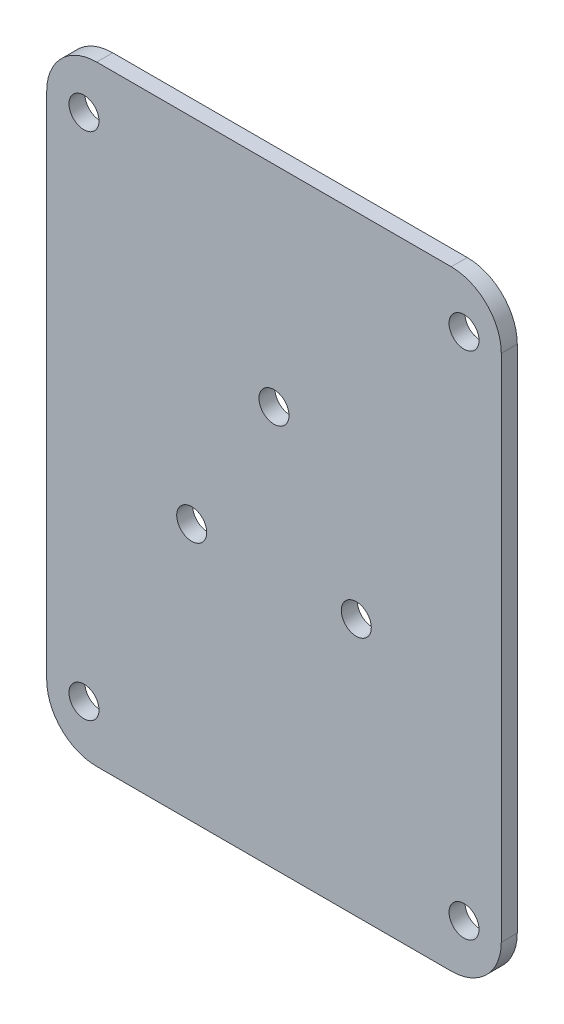
ISO-10303-21;
HEADER;
FILE_DESCRIPTION(('STEP AP214'),'2;1');
FILE_NAME('part.step','',(''),(''),'','','');
FILE_SCHEMA(('AUTOMOTIVE_DESIGN { 1 0 10303 214 1 1 1 1 }'));
ENDSEC;
DATA;
#1=APPLICATION_CONTEXT('core data for automotive mechanical design processes');
#2=APPLICATION_PROTOCOL_DEFINITION('international standard','automotive_design',2000,#1);
#3=PRODUCT_CONTEXT('',#1,'mechanical');
#4=PRODUCT('Part','Part','',(#3));
#5=PRODUCT_RELATED_PRODUCT_CATEGORY('part','',(#4));
#6=PRODUCT_DEFINITION_FORMATION('','',#4);
#7=PRODUCT_DEFINITION_CONTEXT('part definition',#1,'design');
#8=PRODUCT_DEFINITION('design','',#6,#7);
#9=PRODUCT_DEFINITION_SHAPE('','',#8);
#10=(LENGTH_UNIT() NAMED_UNIT(*) SI_UNIT(.MILLI.,.METRE.));
#11=(NAMED_UNIT(*) PLANE_ANGLE_UNIT() SI_UNIT($,.RADIAN.));
#12=(NAMED_UNIT(*) SI_UNIT($,.STERADIAN.) SOLID_ANGLE_UNIT());
#13=UNCERTAINTY_MEASURE_WITH_UNIT(LENGTH_MEASURE(1.E-05),#10,'distance_accuracy_value','');
#14=(GEOMETRIC_REPRESENTATION_CONTEXT(3) GLOBAL_UNCERTAINTY_ASSIGNED_CONTEXT((#13)) GLOBAL_UNIT_ASSIGNED_CONTEXT((#10,
#11,#12)) REPRESENTATION_CONTEXT('',''));
#15=CARTESIAN_POINT('',(0.,0.,0.));
#16=DIRECTION('',(0.,0.,1.));
#17=DIRECTION('',(1.,0.,0.));
#18=AXIS2_PLACEMENT_3D('',#15,#16,#17);
#19=CARTESIAN_POINT('',(0.,0.,1.6));
#20=DIRECTION('',(0.,0.,1.));
#21=DIRECTION('',(1.,0.,0.));
#22=AXIS2_PLACEMENT_3D('',#19,#20,#21);
#23=PLANE('',#22);
#24=CARTESIAN_POINT('',(8.22724133595215,-4.75000000000004,1.6));
#25=DIRECTION('',(0.,0.,1.));
#26=DIRECTION('',(1.,0.,0.));
#27=AXIS2_PLACEMENT_3D('',#24,#25,#26);
#28=CIRCLE('',#27,1.5);
#29=CARTESIAN_POINT('',(9.72724133595215,-4.75000000000004,1.6));
#30=VERTEX_POINT('',#29);
#31=EDGE_CURVE('E210',#30,#30,#28,.T.);
#32=ORIENTED_EDGE('',*,*,#31,.F.);
#33=EDGE_LOOP('',(#32));
#34=FACE_BOUND('',#33,.T.);
#35=CARTESIAN_POINT('',(19.,25.5,1.6));
#36=DIRECTION('',(0.,0.,1.));
#37=DIRECTION('',(1.,0.,0.));
#38=AXIS2_PLACEMENT_3D('',#35,#36,#37);
#39=CIRCLE('',#38,1.5);
#40=CARTESIAN_POINT('',(20.5,25.5,1.6));
#41=VERTEX_POINT('',#40);
#42=EDGE_CURVE('E198',#41,#41,#39,.T.);
#43=ORIENTED_EDGE('',*,*,#42,.F.);
#44=EDGE_LOOP('',(#43));
#45=FACE_BOUND('',#44,.T.);
#46=CARTESIAN_POINT('',(-19.,-25.5,1.6));
#47=DIRECTION('',(0.,0.,1.));
#48=DIRECTION('',(1.,0.,0.));
#49=AXIS2_PLACEMENT_3D('',#46,#47,#48);
#50=CIRCLE('',#49,1.5);
#51=CARTESIAN_POINT('',(-17.5,-25.5,1.6));
#52=VERTEX_POINT('',#51);
#53=EDGE_CURVE('E187',#52,#52,#50,.T.);
#54=ORIENTED_EDGE('',*,*,#53,.F.);
#55=EDGE_LOOP('',(#54));
#56=FACE_BOUND('',#55,.T.);
#57=DIRECTION('',(-1.,0.,0.));
#58=VECTOR('',#57,1.);
#59=CARTESIAN_POINT('',(-22.7254901960784,30.5,1.6));
#60=LINE('',#59,#58);
#61=CARTESIAN_POINT('',(17.7254901960784,30.5,1.6));
#62=VERTEX_POINT('',#61);
#63=CARTESIAN_POINT('',(-17.7254901960784,30.5,1.6));
#64=VERTEX_POINT('',#63);
#65=EDGE_CURVE('E173',#62,#64,#60,.T.);
#66=ORIENTED_EDGE('',*,*,#65,.T.);
#67=CARTESIAN_POINT('',(-17.7254901960784,25.5,1.6));
#68=DIRECTION('',(0.,0.,1.));
#69=DIRECTION('',(1.,0.,0.));
#70=AXIS2_PLACEMENT_3D('',#67,#68,#69);
#71=CIRCLE('',#70,5.);
#72=CARTESIAN_POINT('',(-22.7254901960784,25.5,1.6));
#73=VERTEX_POINT('',#72);
#74=EDGE_CURVE('E151',#64,#73,#71,.T.);
#75=ORIENTED_EDGE('',*,*,#74,.T.);
#76=DIRECTION('',(0.,-1.,0.));
#77=VECTOR('',#76,1.);
#78=CARTESIAN_POINT('',(-22.7254901960784,30.5,1.6));
#79=LINE('',#78,#77);
#80=CARTESIAN_POINT('',(-22.7254901960784,-25.5,1.6));
#81=VERTEX_POINT('',#80);
#82=EDGE_CURVE('E121',#73,#81,#79,.T.);
#83=ORIENTED_EDGE('',*,*,#82,.T.);
#84=CARTESIAN_POINT('',(-17.7254901960784,-25.5,1.6));
#85=DIRECTION('',(0.,0.,1.));
#86=DIRECTION('',(1.,0.,0.));
#87=AXIS2_PLACEMENT_3D('',#84,#85,#86);
#88=CIRCLE('',#87,5.);
#89=CARTESIAN_POINT('',(-17.7254901960784,-30.5,1.6));
#90=VERTEX_POINT('',#89);
#91=EDGE_CURVE('E57',#81,#90,#88,.T.);
#92=ORIENTED_EDGE('',*,*,#91,.T.);
#93=DIRECTION('',(1.,0.,0.));
#94=VECTOR('',#93,1.);
#95=CARTESIAN_POINT('',(-22.7254901960784,-30.5,1.6));
#96=LINE('',#95,#94);
#97=CARTESIAN_POINT('',(17.7254901960784,-30.5,1.6));
#98=VERTEX_POINT('',#97);
#99=EDGE_CURVE('E137',#90,#98,#96,.T.);
#100=ORIENTED_EDGE('',*,*,#99,.T.);
#101=CARTESIAN_POINT('',(17.7254901960784,-25.5,1.6));
#102=DIRECTION('',(0.,0.,1.));
#103=DIRECTION('',(1.,0.,0.));
#104=AXIS2_PLACEMENT_3D('',#101,#102,#103);
#105=CIRCLE('',#104,5.);
#106=CARTESIAN_POINT('',(22.7254901960784,-25.5,1.6));
#107=VERTEX_POINT('',#106);
#108=EDGE_CURVE('E147',#98,#107,#105,.T.);
#109=ORIENTED_EDGE('',*,*,#108,.T.);
#110=DIRECTION('',(0.,1.,0.));
#111=VECTOR('',#110,1.);
#112=CARTESIAN_POINT('',(22.7254901960784,30.5,1.6));
#113=LINE('',#112,#111);
#114=CARTESIAN_POINT('',(22.7254901960784,25.5,1.6));
#115=VERTEX_POINT('',#114);
#116=EDGE_CURVE('E131',#107,#115,#113,.T.);
#117=ORIENTED_EDGE('',*,*,#116,.T.);
#118=CARTESIAN_POINT('',(17.7254901960784,25.5,1.6));
#119=DIRECTION('',(0.,0.,1.));
#120=DIRECTION('',(1.,0.,0.));
#121=AXIS2_PLACEMENT_3D('',#118,#119,#120);
#122=CIRCLE('',#121,5.);
#123=EDGE_CURVE('E149',#115,#62,#122,.T.);
#124=ORIENTED_EDGE('',*,*,#123,.T.);
#125=EDGE_LOOP('',(#66,#75,#83,#92,#100,#109,#117,#124));
#126=FACE_BOUND('',#125,.T.);
#127=CARTESIAN_POINT('',(19.,-25.5,1.6));
#128=DIRECTION('',(0.,0.,1.));
#129=DIRECTION('',(1.,0.,0.));
#130=AXIS2_PLACEMENT_3D('',#127,#128,#129);
#131=CIRCLE('',#130,1.5);
#132=CARTESIAN_POINT('',(20.5,-25.5,1.6));
#133=VERTEX_POINT('',#132);
#134=EDGE_CURVE('E182',#133,#133,#131,.T.);
#135=ORIENTED_EDGE('',*,*,#134,.F.);
#136=EDGE_LOOP('',(#135));
#137=FACE_BOUND('',#136,.T.);
#138=CARTESIAN_POINT('',(-19.,25.5,1.6));
#139=DIRECTION('',(0.,0.,1.));
#140=DIRECTION('',(1.,0.,0.));
#141=AXIS2_PLACEMENT_3D('',#138,#139,#140);
#142=CIRCLE('',#141,1.5);
#143=CARTESIAN_POINT('',(-17.5,25.5,1.6));
#144=VERTEX_POINT('',#143);
#145=EDGE_CURVE('E192',#144,#144,#142,.T.);
#146=ORIENTED_EDGE('',*,*,#145,.F.);
#147=EDGE_LOOP('',(#146));
#148=FACE_BOUND('',#147,.T.);
#149=CARTESIAN_POINT('',(-8.22724133595214,-4.75000000000004,1.6));
#150=DIRECTION('',(0.,0.,1.));
#151=DIRECTION('',(1.,0.,0.));
#152=AXIS2_PLACEMENT_3D('',#149,#150,#151);
#153=CIRCLE('',#152,1.50000000000001);
#154=CARTESIAN_POINT('',(-6.72724133595214,-4.75000000000004,1.6));
#155=VERTEX_POINT('',#154);
#156=EDGE_CURVE('E204',#155,#155,#153,.T.);
#157=ORIENTED_EDGE('',*,*,#156,.F.);
#158=EDGE_LOOP('',(#157));
#159=FACE_BOUND('',#158,.T.);
#160=CARTESIAN_POINT('',(0.,9.5,1.6));
#161=DIRECTION('',(0.,0.,1.));
#162=DIRECTION('',(1.,0.,0.));
#163=AXIS2_PLACEMENT_3D('',#160,#161,#162);
#164=CIRCLE('',#163,1.5);
#165=CARTESIAN_POINT('',(1.50000000000001,9.5,1.6));
#166=VERTEX_POINT('',#165);
#167=EDGE_CURVE('E216',#166,#166,#164,.T.);
#168=ORIENTED_EDGE('',*,*,#167,.F.);
#169=EDGE_LOOP('',(#168));
#170=FACE_BOUND('',#169,.T.);
#171=ADVANCED_FACE('F37',(#34,#45,#56,#126,#137,#148,#159,#170),#23,.T.);
#172=CARTESIAN_POINT('',(0.,0.,0.));
#173=DIRECTION('',(0.,0.,1.));
#174=DIRECTION('',(1.,0.,0.));
#175=AXIS2_PLACEMENT_3D('',#172,#173,#174);
#176=PLANE('',#175);
#177=CARTESIAN_POINT('',(8.22724133595215,-4.75000000000004,0.));
#178=DIRECTION('',(0.,0.,1.));
#179=DIRECTION('',(1.,0.,0.));
#180=AXIS2_PLACEMENT_3D('',#177,#178,#179);
#181=CIRCLE('',#180,1.5);
#182=CARTESIAN_POINT('',(9.72724133595215,-4.75000000000004,0.));
#183=VERTEX_POINT('',#182);
#184=EDGE_CURVE('E213',#183,#183,#181,.T.);
#185=ORIENTED_EDGE('',*,*,#184,.T.);
#186=EDGE_LOOP('',(#185));
#187=FACE_BOUND('',#186,.T.);
#188=CARTESIAN_POINT('',(19.,25.5,0.));
#189=DIRECTION('',(0.,0.,1.));
#190=DIRECTION('',(1.,0.,0.));
#191=AXIS2_PLACEMENT_3D('',#188,#189,#190);
#192=CIRCLE('',#191,1.5);
#193=CARTESIAN_POINT('',(20.5,25.5,0.));
#194=VERTEX_POINT('',#193);
#195=EDGE_CURVE('E201',#194,#194,#192,.T.);
#196=ORIENTED_EDGE('',*,*,#195,.T.);
#197=EDGE_LOOP('',(#196));
#198=FACE_BOUND('',#197,.T.);
#199=CARTESIAN_POINT('',(-19.,-25.5,0.));
#200=DIRECTION('',(0.,0.,1.));
#201=DIRECTION('',(1.,0.,0.));
#202=AXIS2_PLACEMENT_3D('',#199,#200,#201);
#203=CIRCLE('',#202,1.5);
#204=CARTESIAN_POINT('',(-17.5,-25.5,0.));
#205=VERTEX_POINT('',#204);
#206=EDGE_CURVE('E189',#205,#205,#203,.T.);
#207=ORIENTED_EDGE('',*,*,#206,.T.);
#208=EDGE_LOOP('',(#207));
#209=FACE_BOUND('',#208,.T.);
#210=DIRECTION('',(0.,-1.,0.));
#211=VECTOR('',#210,1.);
#212=CARTESIAN_POINT('',(-22.7254901960784,30.5,0.));
#213=LINE('',#212,#211);
#214=CARTESIAN_POINT('',(-22.7254901960784,25.5,0.));
#215=VERTEX_POINT('',#214);
#216=CARTESIAN_POINT('',(-22.7254901960784,-25.5,0.));
#217=VERTEX_POINT('',#216);
#218=EDGE_CURVE('E119',#215,#217,#213,.T.);
#219=ORIENTED_EDGE('',*,*,#218,.F.);
#220=CARTESIAN_POINT('',(-17.7254901960784,25.5,0.));
#221=DIRECTION('',(0.,0.,1.));
#222=DIRECTION('',(1.,0.,0.));
#223=AXIS2_PLACEMENT_3D('',#220,#221,#222);
#224=CIRCLE('',#223,5.);
#225=CARTESIAN_POINT('',(-17.7254901960784,30.5,0.));
#226=VERTEX_POINT('',#225);
#227=EDGE_CURVE('E102',#215,#226,#224,.F.);
#228=ORIENTED_EDGE('',*,*,#227,.T.);
#229=DIRECTION('',(-1.,0.,0.));
#230=VECTOR('',#229,1.);
#231=CARTESIAN_POINT('',(-22.7254901960784,30.5,0.));
#232=LINE('',#231,#230);
#233=CARTESIAN_POINT('',(17.7254901960784,30.5,0.));
#234=VERTEX_POINT('',#233);
#235=EDGE_CURVE('E129',#234,#226,#232,.T.);
#236=ORIENTED_EDGE('',*,*,#235,.F.);
#237=CARTESIAN_POINT('',(17.7254901960784,25.5,0.));
#238=DIRECTION('',(0.,0.,1.));
#239=DIRECTION('',(1.,0.,0.));
#240=AXIS2_PLACEMENT_3D('',#237,#238,#239);
#241=CIRCLE('',#240,5.);
#242=CARTESIAN_POINT('',(22.7254901960784,25.5,0.));
#243=VERTEX_POINT('',#242);
#244=EDGE_CURVE('E113',#234,#243,#241,.F.);
#245=ORIENTED_EDGE('',*,*,#244,.T.);
#246=DIRECTION('',(0.,1.,0.));
#247=VECTOR('',#246,1.);
#248=CARTESIAN_POINT('',(22.7254901960784,30.5,0.));
#249=LINE('',#248,#247);
#250=CARTESIAN_POINT('',(22.7254901960784,-25.5,0.));
#251=VERTEX_POINT('',#250);
#252=EDGE_CURVE('E133',#251,#243,#249,.T.);
#253=ORIENTED_EDGE('',*,*,#252,.F.);
#254=CARTESIAN_POINT('',(17.7254901960784,-25.5,0.));
#255=DIRECTION('',(0.,0.,1.));
#256=DIRECTION('',(1.,0.,0.));
#257=AXIS2_PLACEMENT_3D('',#254,#255,#256);
#258=CIRCLE('',#257,5.);
#259=CARTESIAN_POINT('',(17.7254901960784,-30.5,0.));
#260=VERTEX_POINT('',#259);
#261=EDGE_CURVE('E140',#251,#260,#258,.F.);
#262=ORIENTED_EDGE('',*,*,#261,.T.);
#263=DIRECTION('',(1.,0.,0.));
#264=VECTOR('',#263,1.);
#265=CARTESIAN_POINT('',(-22.7254901960784,-30.5,0.));
#266=LINE('',#265,#264);
#267=CARTESIAN_POINT('',(-17.7254901960784,-30.5,0.));
#268=VERTEX_POINT('',#267);
#269=EDGE_CURVE('E128',#268,#260,#266,.T.);
#270=ORIENTED_EDGE('',*,*,#269,.F.);
#271=CARTESIAN_POINT('',(-17.7254901960784,-25.5,0.));
#272=DIRECTION('',(0.,0.,1.));
#273=DIRECTION('',(1.,0.,0.));
#274=AXIS2_PLACEMENT_3D('',#271,#272,#273);
#275=CIRCLE('',#274,5.);
#276=EDGE_CURVE('E122',#268,#217,#275,.F.);
#277=ORIENTED_EDGE('',*,*,#276,.T.);
#278=EDGE_LOOP('',(#219,#228,#236,#245,#253,#262,#270,#277));
#279=FACE_BOUND('',#278,.T.);
#280=CARTESIAN_POINT('',(19.,-25.5,0.));
#281=DIRECTION('',(0.,0.,1.));
#282=DIRECTION('',(1.,0.,0.));
#283=AXIS2_PLACEMENT_3D('',#280,#281,#282);
#284=CIRCLE('',#283,1.5);
#285=CARTESIAN_POINT('',(20.5,-25.5,0.));
#286=VERTEX_POINT('',#285);
#287=EDGE_CURVE('E178',#286,#286,#284,.T.);
#288=ORIENTED_EDGE('',*,*,#287,.T.);
#289=EDGE_LOOP('',(#288));
#290=FACE_BOUND('',#289,.T.);
#291=CARTESIAN_POINT('',(-19.,25.5,0.));
#292=DIRECTION('',(0.,0.,1.));
#293=DIRECTION('',(1.,0.,0.));
#294=AXIS2_PLACEMENT_3D('',#291,#292,#293);
#295=CIRCLE('',#294,1.5);
#296=CARTESIAN_POINT('',(-17.5,25.5,0.));
#297=VERTEX_POINT('',#296);
#298=EDGE_CURVE('E195',#297,#297,#295,.T.);
#299=ORIENTED_EDGE('',*,*,#298,.T.);
#300=EDGE_LOOP('',(#299));
#301=FACE_BOUND('',#300,.T.);
#302=CARTESIAN_POINT('',(-8.22724133595214,-4.75000000000004,0.));
#303=DIRECTION('',(0.,0.,1.));
#304=DIRECTION('',(1.,0.,0.));
#305=AXIS2_PLACEMENT_3D('',#302,#303,#304);
#306=CIRCLE('',#305,1.50000000000001);
#307=CARTESIAN_POINT('',(-6.72724133595214,-4.75000000000004,0.));
#308=VERTEX_POINT('',#307);
#309=EDGE_CURVE('E207',#308,#308,#306,.T.);
#310=ORIENTED_EDGE('',*,*,#309,.T.);
#311=EDGE_LOOP('',(#310));
#312=FACE_BOUND('',#311,.T.);
#313=CARTESIAN_POINT('',(0.,9.5,0.));
#314=DIRECTION('',(0.,0.,1.));
#315=DIRECTION('',(1.,0.,0.));
#316=AXIS2_PLACEMENT_3D('',#313,#314,#315);
#317=CIRCLE('',#316,1.5);
#318=CARTESIAN_POINT('',(1.50000000000001,9.5,0.));
#319=VERTEX_POINT('',#318);
#320=EDGE_CURVE('E219',#319,#319,#317,.T.);
#321=ORIENTED_EDGE('',*,*,#320,.T.);
#322=EDGE_LOOP('',(#321));
#323=FACE_BOUND('',#322,.T.);
#324=ADVANCED_FACE('F125',(#187,#198,#209,#279,#290,#301,#312,#323),#176,.F.);
#325=CARTESIAN_POINT('',(22.7254901960784,30.5,1.6));
#326=DIRECTION('',(-1.,0.,0.));
#327=DIRECTION('',(0.,0.,1.));
#328=AXIS2_PLACEMENT_3D('',#325,#326,#327);
#329=PLANE('',#328);
#330=ORIENTED_EDGE('',*,*,#252,.T.);
#331=DIRECTION('',(0.,0.,-1.));
#332=VECTOR('',#331,1.);
#333=CARTESIAN_POINT('',(22.7254901960784,25.5,1.6));
#334=LINE('',#333,#332);
#335=EDGE_CURVE('E156',#243,#115,#334,.F.);
#336=ORIENTED_EDGE('',*,*,#335,.T.);
#337=ORIENTED_EDGE('',*,*,#116,.F.);
#338=DIRECTION('',(0.,0.,-1.));
#339=VECTOR('',#338,1.);
#340=CARTESIAN_POINT('',(22.7254901960784,-25.5,1.6));
#341=LINE('',#340,#339);
#342=EDGE_CURVE('E153',#107,#251,#341,.T.);
#343=ORIENTED_EDGE('',*,*,#342,.T.);
#344=EDGE_LOOP('',(#330,#336,#337,#343));
#345=FACE_BOUND('',#344,.T.);
#346=ADVANCED_FACE('F169',(#345),#329,.F.);
#347=CARTESIAN_POINT('',(-22.7254901960784,30.5,1.6));
#348=DIRECTION('',(0.,-1.,0.));
#349=DIRECTION('',(0.,0.,-1.));
#350=AXIS2_PLACEMENT_3D('',#347,#348,#349);
#351=PLANE('',#350);
#352=ORIENTED_EDGE('',*,*,#235,.T.);
#353=DIRECTION('',(0.,0.,-1.));
#354=VECTOR('',#353,1.);
#355=CARTESIAN_POINT('',(-17.7254901960784,30.5,1.6));
#356=LINE('',#355,#354);
#357=EDGE_CURVE('E107',#226,#64,#356,.F.);
#358=ORIENTED_EDGE('',*,*,#357,.T.);
#359=ORIENTED_EDGE('',*,*,#65,.F.);
#360=DIRECTION('',(0.,0.,-1.));
#361=VECTOR('',#360,1.);
#362=CARTESIAN_POINT('',(17.7254901960784,30.5,1.6));
#363=LINE('',#362,#361);
#364=EDGE_CURVE('E112',#62,#234,#363,.T.);
#365=ORIENTED_EDGE('',*,*,#364,.T.);
#366=EDGE_LOOP('',(#352,#358,#359,#365));
#367=FACE_BOUND('',#366,.T.);
#368=ADVANCED_FACE('F246',(#367),#351,.F.);
#369=CARTESIAN_POINT('',(-22.7254901960784,30.5,1.6));
#370=DIRECTION('',(1.,0.,0.));
#371=DIRECTION('',(0.,0.,-1.));
#372=AXIS2_PLACEMENT_3D('',#369,#370,#371);
#373=PLANE('',#372);
#374=ORIENTED_EDGE('',*,*,#82,.F.);
#375=DIRECTION('',(0.,0.,-1.));
#376=VECTOR('',#375,1.);
#377=CARTESIAN_POINT('',(-22.7254901960784,25.5,1.6));
#378=LINE('',#377,#376);
#379=EDGE_CURVE('E106',#73,#215,#378,.T.);
#380=ORIENTED_EDGE('',*,*,#379,.T.);
#381=ORIENTED_EDGE('',*,*,#218,.T.);
#382=DIRECTION('',(0.,0.,-1.));
#383=VECTOR('',#382,1.);
#384=CARTESIAN_POINT('',(-22.7254901960784,-25.5,1.6));
#385=LINE('',#384,#383);
#386=EDGE_CURVE('E123',#217,#81,#385,.F.);
#387=ORIENTED_EDGE('',*,*,#386,.T.);
#388=EDGE_LOOP('',(#374,#380,#381,#387));
#389=FACE_BOUND('',#388,.T.);
#390=ADVANCED_FACE('F118',(#389),#373,.F.);
#391=CARTESIAN_POINT('',(-22.7254901960784,-30.5,1.6));
#392=DIRECTION('',(0.,1.,0.));
#393=DIRECTION('',(0.,0.,1.));
#394=AXIS2_PLACEMENT_3D('',#391,#392,#393);
#395=PLANE('',#394);
#396=ORIENTED_EDGE('',*,*,#269,.T.);
#397=DIRECTION('',(0.,0.,-1.));
#398=VECTOR('',#397,1.);
#399=CARTESIAN_POINT('',(17.7254901960784,-30.5,1.6));
#400=LINE('',#399,#398);
#401=EDGE_CURVE('E11',#260,#98,#400,.F.);
#402=ORIENTED_EDGE('',*,*,#401,.T.);
#403=ORIENTED_EDGE('',*,*,#99,.F.);
#404=DIRECTION('',(0.,0.,-1.));
#405=VECTOR('',#404,1.);
#406=CARTESIAN_POINT('',(-17.7254901960784,-30.5,1.6));
#407=LINE('',#406,#405);
#408=EDGE_CURVE('E45',#90,#268,#407,.T.);
#409=ORIENTED_EDGE('',*,*,#408,.T.);
#410=EDGE_LOOP('',(#396,#402,#403,#409));
#411=FACE_BOUND('',#410,.T.);
#412=ADVANCED_FACE('F159',(#411),#395,.F.);
#413=CARTESIAN_POINT('',(19.,-25.5,1.6));
#414=DIRECTION('',(0.,0.,-1.));
#415=DIRECTION('',(-1.,0.,0.));
#416=AXIS2_PLACEMENT_3D('',#413,#414,#415);
#417=CYLINDRICAL_SURFACE('',#416,1.5);
#418=ORIENTED_EDGE('',*,*,#134,.T.);
#419=EDGE_LOOP('',(#418));
#420=FACE_BOUND('',#419,.T.);
#421=ORIENTED_EDGE('',*,*,#287,.F.);
#422=EDGE_LOOP('',(#421));
#423=FACE_BOUND('',#422,.T.);
#424=ADVANCED_FACE('F239',(#420,#423),#417,.F.);
#425=CARTESIAN_POINT('',(-19.,-25.5,1.6));
#426=DIRECTION('',(0.,0.,-1.));
#427=DIRECTION('',(-1.,0.,0.));
#428=AXIS2_PLACEMENT_3D('',#425,#426,#427);
#429=CYLINDRICAL_SURFACE('',#428,1.5);
#430=ORIENTED_EDGE('',*,*,#53,.T.);
#431=EDGE_LOOP('',(#430));
#432=FACE_BOUND('',#431,.T.);
#433=ORIENTED_EDGE('',*,*,#206,.F.);
#434=EDGE_LOOP('',(#433));
#435=FACE_BOUND('',#434,.T.);
#436=ADVANCED_FACE('F294',(#432,#435),#429,.F.);
#437=CARTESIAN_POINT('',(-19.,25.5,1.6));
#438=DIRECTION('',(0.,0.,-1.));
#439=DIRECTION('',(-1.,0.,0.));
#440=AXIS2_PLACEMENT_3D('',#437,#438,#439);
#441=CYLINDRICAL_SURFACE('',#440,1.5);
#442=ORIENTED_EDGE('',*,*,#145,.T.);
#443=EDGE_LOOP('',(#442));
#444=FACE_BOUND('',#443,.T.);
#445=ORIENTED_EDGE('',*,*,#298,.F.);
#446=EDGE_LOOP('',(#445));
#447=FACE_BOUND('',#446,.T.);
#448=ADVANCED_FACE('F291',(#444,#447),#441,.F.);
#449=CARTESIAN_POINT('',(19.,25.5,1.6));
#450=DIRECTION('',(0.,0.,-1.));
#451=DIRECTION('',(-1.,0.,0.));
#452=AXIS2_PLACEMENT_3D('',#449,#450,#451);
#453=CYLINDRICAL_SURFACE('',#452,1.5);
#454=ORIENTED_EDGE('',*,*,#42,.T.);
#455=EDGE_LOOP('',(#454));
#456=FACE_BOUND('',#455,.T.);
#457=ORIENTED_EDGE('',*,*,#195,.F.);
#458=EDGE_LOOP('',(#457));
#459=FACE_BOUND('',#458,.T.);
#460=ADVANCED_FACE('F275',(#456,#459),#453,.F.);
#461=CARTESIAN_POINT('',(-8.22724133595214,-4.75000000000004,1.6));
#462=DIRECTION('',(0.,0.,-1.));
#463=DIRECTION('',(-1.,0.,0.));
#464=AXIS2_PLACEMENT_3D('',#461,#462,#463);
#465=CYLINDRICAL_SURFACE('',#464,1.50000000000001);
#466=ORIENTED_EDGE('',*,*,#156,.T.);
#467=EDGE_LOOP('',(#466));
#468=FACE_BOUND('',#467,.T.);
#469=ORIENTED_EDGE('',*,*,#309,.F.);
#470=EDGE_LOOP('',(#469));
#471=FACE_BOUND('',#470,.T.);
#472=ADVANCED_FACE('F271',(#468,#471),#465,.F.);
#473=CARTESIAN_POINT('',(8.22724133595215,-4.75000000000004,1.6));
#474=DIRECTION('',(0.,0.,-1.));
#475=DIRECTION('',(-1.,0.,0.));
#476=AXIS2_PLACEMENT_3D('',#473,#474,#475);
#477=CYLINDRICAL_SURFACE('',#476,1.5);
#478=ORIENTED_EDGE('',*,*,#31,.T.);
#479=EDGE_LOOP('',(#478));
#480=FACE_BOUND('',#479,.T.);
#481=ORIENTED_EDGE('',*,*,#184,.F.);
#482=EDGE_LOOP('',(#481));
#483=FACE_BOUND('',#482,.T.);
#484=ADVANCED_FACE('F274',(#480,#483),#477,.F.);
#485=CARTESIAN_POINT('',(0.,9.5,1.6));
#486=DIRECTION('',(0.,0.,-1.));
#487=DIRECTION('',(-1.,0.,0.));
#488=AXIS2_PLACEMENT_3D('',#485,#486,#487);
#489=CYLINDRICAL_SURFACE('',#488,1.5);
#490=ORIENTED_EDGE('',*,*,#167,.T.);
#491=EDGE_LOOP('',(#490));
#492=FACE_BOUND('',#491,.T.);
#493=ORIENTED_EDGE('',*,*,#320,.F.);
#494=EDGE_LOOP('',(#493));
#495=FACE_BOUND('',#494,.T.);
#496=ADVANCED_FACE('F225',(#492,#495),#489,.F.);
#497=CARTESIAN_POINT('',(-17.7254901960784,25.5,1.6));
#498=DIRECTION('',(0.,0.,-1.));
#499=DIRECTION('',(-1.,0.,0.));
#500=AXIS2_PLACEMENT_3D('',#497,#498,#499);
#501=CYLINDRICAL_SURFACE('',#500,5.);
#502=ORIENTED_EDGE('',*,*,#74,.F.);
#503=ORIENTED_EDGE('',*,*,#357,.F.);
#504=ORIENTED_EDGE('',*,*,#227,.F.);
#505=ORIENTED_EDGE('',*,*,#379,.F.);
#506=EDGE_LOOP('',(#502,#503,#504,#505));
#507=FACE_BOUND('',#506,.T.);
#508=ADVANCED_FACE('F105',(#507),#501,.T.);
#509=CARTESIAN_POINT('',(17.7254901960784,25.5,1.6));
#510=DIRECTION('',(0.,0.,-1.));
#511=DIRECTION('',(-1.,0.,0.));
#512=AXIS2_PLACEMENT_3D('',#509,#510,#511);
#513=CYLINDRICAL_SURFACE('',#512,5.);
#514=ORIENTED_EDGE('',*,*,#123,.F.);
#515=ORIENTED_EDGE('',*,*,#335,.F.);
#516=ORIENTED_EDGE('',*,*,#244,.F.);
#517=ORIENTED_EDGE('',*,*,#364,.F.);
#518=EDGE_LOOP('',(#514,#515,#516,#517));
#519=FACE_BOUND('',#518,.T.);
#520=ADVANCED_FACE('F254',(#519),#513,.T.);
#521=CARTESIAN_POINT('',(17.7254901960784,-25.5,1.6));
#522=DIRECTION('',(0.,0.,-1.));
#523=DIRECTION('',(-1.,0.,0.));
#524=AXIS2_PLACEMENT_3D('',#521,#522,#523);
#525=CYLINDRICAL_SURFACE('',#524,5.);
#526=ORIENTED_EDGE('',*,*,#108,.F.);
#527=ORIENTED_EDGE('',*,*,#401,.F.);
#528=ORIENTED_EDGE('',*,*,#261,.F.);
#529=ORIENTED_EDGE('',*,*,#342,.F.);
#530=EDGE_LOOP('',(#526,#527,#528,#529));
#531=FACE_BOUND('',#530,.T.);
#532=ADVANCED_FACE('F166',(#531),#525,.T.);
#533=CARTESIAN_POINT('',(-17.7254901960784,-25.5,1.6));
#534=DIRECTION('',(0.,0.,-1.));
#535=DIRECTION('',(-1.,0.,0.));
#536=AXIS2_PLACEMENT_3D('',#533,#534,#535);
#537=CYLINDRICAL_SURFACE('',#536,5.);
#538=ORIENTED_EDGE('',*,*,#91,.F.);
#539=ORIENTED_EDGE('',*,*,#386,.F.);
#540=ORIENTED_EDGE('',*,*,#276,.F.);
#541=ORIENTED_EDGE('',*,*,#408,.F.);
#542=EDGE_LOOP('',(#538,#539,#540,#541));
#543=FACE_BOUND('',#542,.T.);
#544=ADVANCED_FACE('F39',(#543),#537,.T.);
#545=CLOSED_SHELL('',(#171,#324,#346,#368,#390,#412,#424,#436,#448,#460,#472,#484,#496,#508,
#520,#532,#544));
#546=MANIFOLD_SOLID_BREP('B2',#545);
#547=ADVANCED_BREP_SHAPE_REPRESENTATION('',(#18,#546),#14);
#548=SHAPE_DEFINITION_REPRESENTATION(#9,#547);
ENDSEC;
END-ISO-10303-21;
